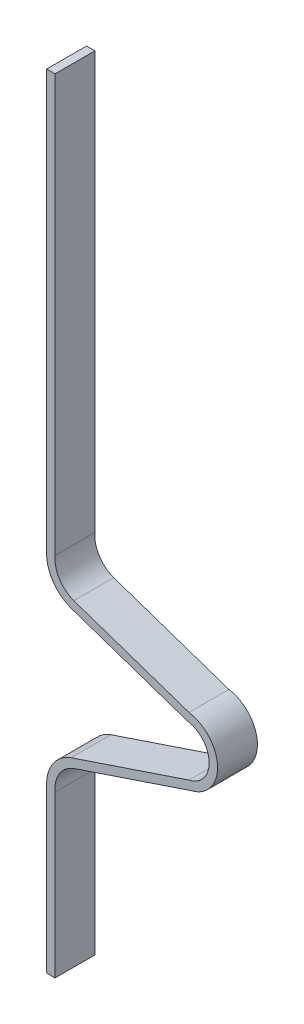
ISO-10303-21;
HEADER;
FILE_DESCRIPTION(('STEP AP214'),'2;1');
FILE_NAME('part.step','',(''),(''),'','','');
FILE_SCHEMA(('AUTOMOTIVE_DESIGN { 1 0 10303 214 1 1 1 1 }'));
ENDSEC;
DATA;
#1=APPLICATION_CONTEXT('core data for automotive mechanical design processes');
#2=APPLICATION_PROTOCOL_DEFINITION('international standard','automotive_design',2000,#1);
#3=PRODUCT_CONTEXT('',#1,'mechanical');
#4=PRODUCT('Part','Part','',(#3));
#5=PRODUCT_RELATED_PRODUCT_CATEGORY('part','',(#4));
#6=PRODUCT_DEFINITION_FORMATION('','',#4);
#7=PRODUCT_DEFINITION_CONTEXT('part definition',#1,'design');
#8=PRODUCT_DEFINITION('design','',#6,#7);
#9=PRODUCT_DEFINITION_SHAPE('','',#8);
#10=(LENGTH_UNIT() NAMED_UNIT(*) SI_UNIT(.MILLI.,.METRE.));
#11=(NAMED_UNIT(*) PLANE_ANGLE_UNIT() SI_UNIT($,.RADIAN.));
#12=(NAMED_UNIT(*) SI_UNIT($,.STERADIAN.) SOLID_ANGLE_UNIT());
#13=UNCERTAINTY_MEASURE_WITH_UNIT(LENGTH_MEASURE(1.E-05),#10,'distance_accuracy_value','');
#14=(GEOMETRIC_REPRESENTATION_CONTEXT(3) GLOBAL_UNCERTAINTY_ASSIGNED_CONTEXT((#13)) GLOBAL_UNIT_ASSIGNED_CONTEXT((#10,
#11,#12)) REPRESENTATION_CONTEXT('',''));
#15=CARTESIAN_POINT('',(0.,0.,0.));
#16=DIRECTION('',(0.,0.,1.));
#17=DIRECTION('',(1.,0.,0.));
#18=AXIS2_PLACEMENT_3D('',#15,#16,#17);
#19=CARTESIAN_POINT('',(7.50002729636842,136.890987131087,-6.2));
#20=DIRECTION('',(0.,0.,1.));
#21=DIRECTION('',(1.,0.,0.));
#22=AXIS2_PLACEMENT_3D('',#19,#20,#21);
#23=CYLINDRICAL_SURFACE('',#22,5.80000000000005);
#24=CARTESIAN_POINT('',(7.50002729636842,136.890987131087,0.));
#25=DIRECTION('',(0.,0.,-1.));
#26=DIRECTION('',(-1.,0.,0.));
#27=AXIS2_PLACEMENT_3D('',#24,#25,#26);
#28=CIRCLE('',#27,5.80000000000005);
#29=CARTESIAN_POINT('',(5.50463373490959,131.445034089158,0.));
#30=VERTEX_POINT('',#29);
#31=CARTESIAN_POINT('',(1.71947576625623,137.365564846238,0.));
#32=VERTEX_POINT('',#31);
#33=EDGE_CURVE('E183',#30,#32,#28,.T.);
#34=ORIENTED_EDGE('',*,*,#33,.T.);
#35=DIRECTION('',(0.,0.,1.));
#36=VECTOR('',#35,1.);
#37=CARTESIAN_POINT('',(1.71947576625623,137.365564846238,-6.2));
#38=LINE('',#37,#36);
#39=CARTESIAN_POINT('',(1.71947576625623,137.365564846238,-6.2));
#40=VERTEX_POINT('',#39);
#41=EDGE_CURVE('E39',#40,#32,#38,.T.);
#42=ORIENTED_EDGE('',*,*,#41,.F.);
#43=CARTESIAN_POINT('',(7.50002729636842,136.890987131087,-6.2));
#44=DIRECTION('',(0.,0.,-1.));
#45=DIRECTION('',(-1.,0.,0.));
#46=AXIS2_PLACEMENT_3D('',#43,#44,#45);
#47=CIRCLE('',#46,5.80000000000005);
#48=CARTESIAN_POINT('',(5.50463373490959,131.445034089158,-6.2));
#49=VERTEX_POINT('',#48);
#50=EDGE_CURVE('E221',#49,#40,#47,.T.);
#51=ORIENTED_EDGE('',*,*,#50,.F.);
#52=DIRECTION('',(0.,0.,1.));
#53=VECTOR('',#52,1.);
#54=CARTESIAN_POINT('',(5.50463373490959,131.445034089158,-6.2));
#55=LINE('',#54,#53);
#56=EDGE_CURVE('E182',#49,#30,#55,.T.);
#57=ORIENTED_EDGE('',*,*,#56,.T.);
#58=EDGE_LOOP('',(#34,#42,#51,#57));
#59=FACE_BOUND('',#58,.T.);
#60=ADVANCED_FACE('F32',(#59),#23,.T.);
#61=CARTESIAN_POINT('',(1.71947576625623,137.365564846238,-6.2));
#62=DIRECTION('',(1.,0.,0.));
#63=DIRECTION('',(0.,1.,0.));
#64=AXIS2_PLACEMENT_3D('',#61,#62,#63);
#65=PLANE('',#64);
#66=DIRECTION('',(0.,1.,0.));
#67=VECTOR('',#66,1.);
#68=CARTESIAN_POINT('',(1.71947576625623,137.365564846238,0.));
#69=LINE('',#68,#67);
#70=CARTESIAN_POINT('',(1.71947576625623,202.142033293371,0.));
#71=VERTEX_POINT('',#70);
#72=EDGE_CURVE('E186',#32,#71,#69,.T.);
#73=ORIENTED_EDGE('',*,*,#72,.T.);
#74=DIRECTION('',(0.,0.,-1.));
#75=VECTOR('',#74,1.);
#76=CARTESIAN_POINT('',(1.71947576625623,202.142033293371,-6.2));
#77=LINE('',#76,#75);
#78=CARTESIAN_POINT('',(1.71947576625623,202.142033293371,-6.2));
#79=VERTEX_POINT('',#78);
#80=EDGE_CURVE('E54',#71,#79,#77,.T.);
#81=ORIENTED_EDGE('',*,*,#80,.T.);
#82=DIRECTION('',(0.,1.,0.));
#83=VECTOR('',#82,1.);
#84=CARTESIAN_POINT('',(1.71947576625623,137.365564846238,-6.2));
#85=LINE('',#84,#83);
#86=EDGE_CURVE('E248',#40,#79,#85,.T.);
#87=ORIENTED_EDGE('',*,*,#86,.F.);
#88=ORIENTED_EDGE('',*,*,#41,.T.);
#89=EDGE_LOOP('',(#73,#81,#87,#88));
#90=FACE_BOUND('',#89,.T.);
#91=ADVANCED_FACE('F246',(#90),#65,.F.);
#92=CARTESIAN_POINT('',(3.01947576625623,137.308908159523,-6.2));
#93=DIRECTION('',(1.,0.,0.));
#94=DIRECTION('',(0.,1.,0.));
#95=AXIS2_PLACEMENT_3D('',#92,#93,#94);
#96=PLANE('',#95);
#97=DIRECTION('',(0.,0.,-1.));
#98=VECTOR('',#97,1.);
#99=CARTESIAN_POINT('',(3.01947576625058,202.142033293371,-6.2));
#100=LINE('',#99,#98);
#101=CARTESIAN_POINT('',(3.01947576625058,202.142033293371,0.));
#102=VERTEX_POINT('',#101);
#103=CARTESIAN_POINT('',(3.01947576625058,202.142033293371,-6.2));
#104=VERTEX_POINT('',#103);
#105=EDGE_CURVE('E277',#102,#104,#100,.T.);
#106=ORIENTED_EDGE('',*,*,#105,.F.);
#107=DIRECTION('',(0.,1.,0.));
#108=VECTOR('',#107,1.);
#109=CARTESIAN_POINT('',(3.01947576625623,137.308908159523,0.));
#110=LINE('',#109,#108);
#111=CARTESIAN_POINT('',(3.01947576625623,137.308908159523,0.));
#112=VERTEX_POINT('',#111);
#113=EDGE_CURVE('E189',#112,#102,#110,.T.);
#114=ORIENTED_EDGE('',*,*,#113,.F.);
#115=DIRECTION('',(0.,0.,1.));
#116=VECTOR('',#115,1.);
#117=CARTESIAN_POINT('',(3.01947576625623,137.308908159523,-6.2));
#118=LINE('',#117,#116);
#119=CARTESIAN_POINT('',(3.01947576625623,137.308908159523,-6.2));
#120=VERTEX_POINT('',#119);
#121=EDGE_CURVE('E242',#120,#112,#118,.T.);
#122=ORIENTED_EDGE('',*,*,#121,.F.);
#123=DIRECTION('',(0.,1.,0.));
#124=VECTOR('',#123,1.);
#125=CARTESIAN_POINT('',(3.01947576625623,137.308908159523,-6.2));
#126=LINE('',#125,#124);
#127=EDGE_CURVE('E287',#120,#104,#126,.T.);
#128=ORIENTED_EDGE('',*,*,#127,.T.);
#129=EDGE_LOOP('',(#106,#114,#122,#128));
#130=FACE_BOUND('',#129,.T.);
#131=ADVANCED_FACE('F323',(#130),#96,.T.);
#132=CARTESIAN_POINT('',(7.50002729636842,136.890987131087,-6.2));
#133=DIRECTION('',(0.,0.,1.));
#134=DIRECTION('',(1.,0.,0.));
#135=AXIS2_PLACEMENT_3D('',#132,#133,#134);
#136=CYLINDRICAL_SURFACE('',#135,4.50000000000005);
#137=CARTESIAN_POINT('',(7.50002729636842,136.890987131087,0.));
#138=DIRECTION('',(0.,0.,-1.));
#139=DIRECTION('',(-1.,0.,0.));
#140=AXIS2_PLACEMENT_3D('',#137,#138,#139);
#141=CIRCLE('',#140,4.50000000000005);
#142=CARTESIAN_POINT('',(5.93858449700011,132.670572887876,0.));
#143=VERTEX_POINT('',#142);
#144=EDGE_CURVE('E192',#143,#112,#141,.T.);
#145=ORIENTED_EDGE('',*,*,#144,.F.);
#146=DIRECTION('',(0.,0.,1.));
#147=VECTOR('',#146,1.);
#148=CARTESIAN_POINT('',(5.93858449700011,132.670572887876,-6.2));
#149=LINE('',#148,#147);
#150=CARTESIAN_POINT('',(5.93858449700011,132.670572887876,-6.2));
#151=VERTEX_POINT('',#150);
#152=EDGE_CURVE('E240',#151,#143,#149,.T.);
#153=ORIENTED_EDGE('',*,*,#152,.F.);
#154=CARTESIAN_POINT('',(7.50002729636842,136.890987131087,-6.2));
#155=DIRECTION('',(0.,0.,-1.));
#156=DIRECTION('',(-1.,0.,0.));
#157=AXIS2_PLACEMENT_3D('',#154,#155,#156);
#158=CIRCLE('',#157,4.50000000000005);
#159=EDGE_CURVE('E290',#151,#120,#158,.T.);
#160=ORIENTED_EDGE('',*,*,#159,.T.);
#161=ORIENTED_EDGE('',*,*,#121,.T.);
#162=EDGE_LOOP('',(#145,#153,#160,#161));
#163=FACE_BOUND('',#162,.T.);
#164=ADVANCED_FACE('F327',(#163),#136,.F.);
#165=CARTESIAN_POINT('',(5.9385844970001,132.670572887876,-6.2));
#166=DIRECTION('',(-0.322097234531556,-0.946706592090244,0.));
#167=DIRECTION('',(0.946706592090244,-0.322097234531556,0.));
#168=AXIS2_PLACEMENT_3D('',#165,#166,#167);
#169=PLANE('',#168);
#170=DIRECTION('',(0.946706592090244,-0.322097234531556,0.));
#171=VECTOR('',#170,1.);
#172=CARTESIAN_POINT('',(5.9385844970001,132.670572887876,0.));
#173=LINE('',#172,#171);
#174=CARTESIAN_POINT('',(23.8530536017611,126.575547243231,0.));
#175=VERTEX_POINT('',#174);
#176=EDGE_CURVE('E195',#143,#175,#173,.T.);
#177=ORIENTED_EDGE('',*,*,#176,.T.);
#178=DIRECTION('',(0.,0.,1.));
#179=VECTOR('',#178,1.);
#180=CARTESIAN_POINT('',(23.8530536017611,126.575547243231,-6.2));
#181=LINE('',#180,#179);
#182=CARTESIAN_POINT('',(23.8530536017611,126.575547243231,-6.2));
#183=VERTEX_POINT('',#182);
#184=EDGE_CURVE('E238',#183,#175,#181,.T.);
#185=ORIENTED_EDGE('',*,*,#184,.F.);
#186=DIRECTION('',(0.946706592090244,-0.322097234531556,0.));
#187=VECTOR('',#186,1.);
#188=CARTESIAN_POINT('',(5.9385844970001,132.670572887876,-6.2));
#189=LINE('',#188,#187);
#190=EDGE_CURVE('E293',#151,#183,#189,.T.);
#191=ORIENTED_EDGE('',*,*,#190,.F.);
#192=ORIENTED_EDGE('',*,*,#152,.T.);
#193=EDGE_LOOP('',(#177,#185,#191,#192));
#194=FACE_BOUND('',#193,.T.);
#195=ADVANCED_FACE('F333',(#194),#169,.F.);
#196=CARTESIAN_POINT('',(23.0000272963693,121.361325624567,-6.2));
#197=DIRECTION('',(0.,0.,1.));
#198=DIRECTION('',(1.,0.,0.));
#199=AXIS2_PLACEMENT_3D('',#196,#197,#198);
#200=CYLINDRICAL_SURFACE('',#199,5.28353678573665);
#201=CARTESIAN_POINT('',(23.0000272963693,121.361325624567,0.));
#202=DIRECTION('',(0.,0.,1.));
#203=DIRECTION('',(1.,0.,0.));
#204=AXIS2_PLACEMENT_3D('',#201,#202,#203);
#205=CIRCLE('',#204,5.28353678573665);
#206=CARTESIAN_POINT('',(24.1981690487475,116.215432377769,0.));
#207=VERTEX_POINT('',#206);
#208=EDGE_CURVE('E198',#207,#175,#205,.T.);
#209=ORIENTED_EDGE('',*,*,#208,.F.);
#210=DIRECTION('',(0.,0.,1.));
#211=VECTOR('',#210,1.);
#212=CARTESIAN_POINT('',(24.1981690487475,116.215432377769,-6.2));
#213=LINE('',#212,#211);
#214=CARTESIAN_POINT('',(24.1981690487475,116.215432377769,-6.2));
#215=VERTEX_POINT('',#214);
#216=EDGE_CURVE('E236',#215,#207,#213,.T.);
#217=ORIENTED_EDGE('',*,*,#216,.F.);
#218=CARTESIAN_POINT('',(23.0000272963693,121.361325624567,-6.2));
#219=DIRECTION('',(0.,0.,1.));
#220=DIRECTION('',(1.,0.,0.));
#221=AXIS2_PLACEMENT_3D('',#218,#219,#220);
#222=CIRCLE('',#221,5.28353678573665);
#223=EDGE_CURVE('E295',#215,#183,#222,.T.);
#224=ORIENTED_EDGE('',*,*,#223,.T.);
#225=ORIENTED_EDGE('',*,*,#184,.T.);
#226=EDGE_LOOP('',(#209,#217,#224,#225));
#227=FACE_BOUND('',#226,.T.);
#228=ADVANCED_FACE('F307',(#227),#200,.T.);
#229=CARTESIAN_POINT('',(5.93769252692713,110.081409755031,-6.2));
#230=DIRECTION('',(0.318432016999955,-0.947945700211431,0.));
#231=DIRECTION('',(0.947945700211431,0.318432016999955,0.));
#232=AXIS2_PLACEMENT_3D('',#229,#230,#231);
#233=PLANE('',#232);
#234=DIRECTION('',(0.947945700211431,0.318432016999955,0.));
#235=VECTOR('',#234,1.);
#236=CARTESIAN_POINT('',(5.93769252692713,110.081409755031,0.));
#237=LINE('',#236,#235);
#238=CARTESIAN_POINT('',(5.93769252692713,110.081409755031,0.));
#239=VERTEX_POINT('',#238);
#240=EDGE_CURVE('E201',#239,#207,#237,.T.);
#241=ORIENTED_EDGE('',*,*,#240,.F.);
#242=DIRECTION('',(0.,0.,1.));
#243=VECTOR('',#242,1.);
#244=CARTESIAN_POINT('',(5.93769252692713,110.081409755031,-6.2));
#245=LINE('',#244,#243);
#246=CARTESIAN_POINT('',(5.93769252692713,110.081409755031,-6.2));
#247=VERTEX_POINT('',#246);
#248=EDGE_CURVE('E234',#247,#239,#245,.T.);
#249=ORIENTED_EDGE('',*,*,#248,.F.);
#250=DIRECTION('',(0.947945700211431,0.318432016999955,0.));
#251=VECTOR('',#250,1.);
#252=CARTESIAN_POINT('',(5.93769252692713,110.081409755031,-6.2));
#253=LINE('',#252,#251);
#254=EDGE_CURVE('E169',#247,#215,#253,.T.);
#255=ORIENTED_EDGE('',*,*,#254,.T.);
#256=ORIENTED_EDGE('',*,*,#216,.T.);
#257=EDGE_LOOP('',(#241,#249,#255,#256));
#258=FACE_BOUND('',#257,.T.);
#259=ADVANCED_FACE('F300',(#258),#233,.T.);
#260=CARTESIAN_POINT('',(7.50002729636842,105.861325624567,-6.2));
#261=DIRECTION('',(0.,0.,1.));
#262=DIRECTION('',(1.,0.,0.));
#263=AXIS2_PLACEMENT_3D('',#260,#261,#262);
#264=CYLINDRICAL_SURFACE('',#263,4.49999999999999);
#265=CARTESIAN_POINT('',(7.50002729636842,105.861325624567,0.));
#266=DIRECTION('',(0.,0.,1.));
#267=DIRECTION('',(1.,0.,0.));
#268=AXIS2_PLACEMENT_3D('',#265,#266,#267);
#269=CIRCLE('',#268,4.49999999999999);
#270=CARTESIAN_POINT('',(3.01947576625624,105.443404596131,0.));
#271=VERTEX_POINT('',#270);
#272=EDGE_CURVE('E204',#239,#271,#269,.T.);
#273=ORIENTED_EDGE('',*,*,#272,.T.);
#274=DIRECTION('',(0.,0.,1.));
#275=VECTOR('',#274,1.);
#276=CARTESIAN_POINT('',(3.01947576625624,105.443404596131,-6.2));
#277=LINE('',#276,#275);
#278=CARTESIAN_POINT('',(3.01947576625624,105.443404596131,-6.2));
#279=VERTEX_POINT('',#278);
#280=EDGE_CURVE('E232',#279,#271,#277,.T.);
#281=ORIENTED_EDGE('',*,*,#280,.F.);
#282=CARTESIAN_POINT('',(7.50002729636842,105.861325624567,-6.2));
#283=DIRECTION('',(0.,0.,1.));
#284=DIRECTION('',(1.,0.,0.));
#285=AXIS2_PLACEMENT_3D('',#282,#283,#284);
#286=CIRCLE('',#285,4.49999999999999);
#287=EDGE_CURVE('E163',#247,#279,#286,.T.);
#288=ORIENTED_EDGE('',*,*,#287,.F.);
#289=ORIENTED_EDGE('',*,*,#248,.T.);
#290=EDGE_LOOP('',(#273,#281,#288,#289));
#291=FACE_BOUND('',#290,.T.);
#292=ADVANCED_FACE('F310',(#291),#264,.F.);
#293=CARTESIAN_POINT('',(3.01947576625623,105.443404596131,-6.2));
#294=DIRECTION('',(-1.,0.,0.));
#295=DIRECTION('',(0.,-1.,0.));
#296=AXIS2_PLACEMENT_3D('',#293,#294,#295);
#297=PLANE('',#296);
#298=DIRECTION('',(0.,-1.,0.));
#299=VECTOR('',#298,1.);
#300=CARTESIAN_POINT('',(3.01947576625623,105.443404596131,0.));
#301=LINE('',#300,#299);
#302=CARTESIAN_POINT('',(3.01947576625623,80.4063512397133,0.));
#303=VERTEX_POINT('',#302);
#304=EDGE_CURVE('E158',#271,#303,#301,.T.);
#305=ORIENTED_EDGE('',*,*,#304,.T.);
#306=DIRECTION('',(0.,0.,1.));
#307=VECTOR('',#306,1.);
#308=CARTESIAN_POINT('',(3.01947576625848,80.4063512397133,-6.2));
#309=LINE('',#308,#307);
#310=CARTESIAN_POINT('',(3.01947576625848,80.4063512397133,-6.2));
#311=VERTEX_POINT('',#310);
#312=EDGE_CURVE('E46',#311,#303,#309,.T.);
#313=ORIENTED_EDGE('',*,*,#312,.F.);
#314=DIRECTION('',(0.,-1.,0.));
#315=VECTOR('',#314,1.);
#316=CARTESIAN_POINT('',(3.01947576625623,105.443404596131,-6.2));
#317=LINE('',#316,#315);
#318=EDGE_CURVE('E156',#279,#311,#317,.T.);
#319=ORIENTED_EDGE('',*,*,#318,.F.);
#320=ORIENTED_EDGE('',*,*,#280,.T.);
#321=EDGE_LOOP('',(#305,#313,#319,#320));
#322=FACE_BOUND('',#321,.T.);
#323=ADVANCED_FACE('F154',(#322),#297,.F.);
#324=CARTESIAN_POINT('',(1.71947576625623,105.386747909417,-6.2));
#325=DIRECTION('',(-1.,0.,0.));
#326=DIRECTION('',(0.,-1.,0.));
#327=AXIS2_PLACEMENT_3D('',#324,#325,#326);
#328=PLANE('',#327);
#329=DIRECTION('',(0.,0.,-1.));
#330=VECTOR('',#329,1.);
#331=CARTESIAN_POINT('',(1.71947576625623,80.4063512397133,-6.2));
#332=LINE('',#331,#330);
#333=CARTESIAN_POINT('',(1.71947576625623,80.4063512397133,0.));
#334=VERTEX_POINT('',#333);
#335=CARTESIAN_POINT('',(1.71947576625623,80.4063512397133,-6.2));
#336=VERTEX_POINT('',#335);
#337=EDGE_CURVE('E144',#334,#336,#332,.T.);
#338=ORIENTED_EDGE('',*,*,#337,.F.);
#339=DIRECTION('',(0.,-1.,0.));
#340=VECTOR('',#339,1.);
#341=CARTESIAN_POINT('',(1.71947576625623,105.386747909417,0.));
#342=LINE('',#341,#340);
#343=CARTESIAN_POINT('',(1.71947576625623,105.386747909417,0.));
#344=VERTEX_POINT('',#343);
#345=EDGE_CURVE('E207',#344,#334,#342,.T.);
#346=ORIENTED_EDGE('',*,*,#345,.F.);
#347=DIRECTION('',(0.,0.,1.));
#348=VECTOR('',#347,1.);
#349=CARTESIAN_POINT('',(1.71947576625623,105.386747909417,-6.2));
#350=LINE('',#349,#348);
#351=CARTESIAN_POINT('',(1.71947576625623,105.386747909417,-6.2));
#352=VERTEX_POINT('',#351);
#353=EDGE_CURVE('E230',#352,#344,#350,.T.);
#354=ORIENTED_EDGE('',*,*,#353,.F.);
#355=DIRECTION('',(0.,-1.,0.));
#356=VECTOR('',#355,1.);
#357=CARTESIAN_POINT('',(1.71947576625623,105.386747909417,-6.2));
#358=LINE('',#357,#356);
#359=EDGE_CURVE('E165',#352,#336,#358,.T.);
#360=ORIENTED_EDGE('',*,*,#359,.T.);
#361=EDGE_LOOP('',(#338,#346,#354,#360));
#362=FACE_BOUND('',#361,.T.);
#363=ADVANCED_FACE('F274',(#362),#328,.T.);
#364=CARTESIAN_POINT('',(7.50002729636842,105.861325624567,-6.2));
#365=DIRECTION('',(0.,0.,1.));
#366=DIRECTION('',(1.,0.,0.));
#367=AXIS2_PLACEMENT_3D('',#364,#365,#366);
#368=CYLINDRICAL_SURFACE('',#367,5.8);
#369=CARTESIAN_POINT('',(7.50002729636842,105.861325624567,0.));
#370=DIRECTION('',(0.,0.,1.));
#371=DIRECTION('',(1.,0.,0.));
#372=AXIS2_PLACEMENT_3D('',#369,#370,#371);
#373=CIRCLE('',#372,5.8);
#374=CARTESIAN_POINT('',(5.50613135155277,111.307827158694,0.));
#375=VERTEX_POINT('',#374);
#376=EDGE_CURVE('E210',#375,#344,#373,.T.);
#377=ORIENTED_EDGE('',*,*,#376,.F.);
#378=DIRECTION('',(0.,0.,1.));
#379=VECTOR('',#378,1.);
#380=CARTESIAN_POINT('',(5.50613135155277,111.307827158694,-6.2));
#381=LINE('',#380,#379);
#382=CARTESIAN_POINT('',(5.50613135155277,111.307827158694,-6.2));
#383=VERTEX_POINT('',#382);
#384=EDGE_CURVE('E228',#383,#375,#381,.T.);
#385=ORIENTED_EDGE('',*,*,#384,.F.);
#386=CARTESIAN_POINT('',(7.50002729636842,105.861325624567,-6.2));
#387=DIRECTION('',(0.,0.,1.));
#388=DIRECTION('',(1.,0.,0.));
#389=AXIS2_PLACEMENT_3D('',#386,#387,#388);
#390=CIRCLE('',#389,5.8);
#391=EDGE_CURVE('E167',#383,#352,#390,.T.);
#392=ORIENTED_EDGE('',*,*,#391,.T.);
#393=ORIENTED_EDGE('',*,*,#353,.T.);
#394=EDGE_LOOP('',(#377,#385,#392,#393));
#395=FACE_BOUND('',#394,.T.);
#396=ADVANCED_FACE('F269',(#395),#368,.T.);
#397=CARTESIAN_POINT('',(5.50613135155277,111.307827158694,-6.2));
#398=DIRECTION('',(0.318432016999952,-0.947945700211432,0.));
#399=DIRECTION('',(0.947945700211432,0.318432016999952,0.));
#400=AXIS2_PLACEMENT_3D('',#397,#398,#399);
#401=PLANE('',#400);
#402=DIRECTION('',(0.947945700211432,0.318432016999952,0.));
#403=VECTOR('',#402,1.);
#404=CARTESIAN_POINT('',(5.50613135155277,111.307827158694,0.));
#405=LINE('',#404,#403);
#406=CARTESIAN_POINT('',(23.8471362015121,117.468900695792,0.));
#407=VERTEX_POINT('',#406);
#408=EDGE_CURVE('E213',#375,#407,#405,.T.);
#409=ORIENTED_EDGE('',*,*,#408,.T.);
#410=DIRECTION('',(0.,0.,1.));
#411=VECTOR('',#410,1.);
#412=CARTESIAN_POINT('',(23.8471362015121,117.468900695792,-6.2));
#413=LINE('',#412,#411);
#414=CARTESIAN_POINT('',(23.8471362015121,117.468900695792,-6.2));
#415=VERTEX_POINT('',#414);
#416=EDGE_CURVE('E225',#415,#407,#413,.T.);
#417=ORIENTED_EDGE('',*,*,#416,.F.);
#418=DIRECTION('',(0.947945700211432,0.318432016999952,0.));
#419=VECTOR('',#418,1.);
#420=CARTESIAN_POINT('',(5.50613135155277,111.307827158694,-6.2));
#421=LINE('',#420,#419);
#422=EDGE_CURVE('E175',#383,#415,#421,.T.);
#423=ORIENTED_EDGE('',*,*,#422,.F.);
#424=ORIENTED_EDGE('',*,*,#384,.T.);
#425=EDGE_LOOP('',(#409,#417,#423,#424));
#426=FACE_BOUND('',#425,.T.);
#427=ADVANCED_FACE('F361',(#426),#401,.F.);
#428=CARTESIAN_POINT('',(23.0000272963693,121.361325624567,-6.2));
#429=DIRECTION('',(0.,0.,1.));
#430=DIRECTION('',(1.,0.,0.));
#431=AXIS2_PLACEMENT_3D('',#428,#429,#430);
#432=CYLINDRICAL_SURFACE('',#431,3.98353678573665);
#433=CARTESIAN_POINT('',(23.0000272963693,121.361325624567,0.));
#434=DIRECTION('',(0.,0.,1.));
#435=DIRECTION('',(1.,0.,0.));
#436=AXIS2_PLACEMENT_3D('',#433,#434,#435);
#437=CIRCLE('',#436,3.98353678573665);
#438=CARTESIAN_POINT('',(23.5438434058974,125.307568060395,0.));
#439=VERTEX_POINT('',#438);
#440=EDGE_CURVE('E215',#407,#439,#437,.T.);
#441=ORIENTED_EDGE('',*,*,#440,.T.);
#442=DIRECTION('',(0.,0.,1.));
#443=VECTOR('',#442,1.);
#444=CARTESIAN_POINT('',(23.5438434058974,125.307568060395,-6.2));
#445=LINE('',#444,#443);
#446=CARTESIAN_POINT('',(23.5438434058974,125.307568060395,-6.2));
#447=VERTEX_POINT('',#446);
#448=EDGE_CURVE('E223',#447,#439,#445,.T.);
#449=ORIENTED_EDGE('',*,*,#448,.F.);
#450=CARTESIAN_POINT('',(23.0000272963693,121.361325624567,-6.2));
#451=DIRECTION('',(0.,0.,1.));
#452=DIRECTION('',(1.,0.,0.));
#453=AXIS2_PLACEMENT_3D('',#450,#451,#452);
#454=CIRCLE('',#453,3.98353678573665);
#455=EDGE_CURVE('E177',#415,#447,#454,.T.);
#456=ORIENTED_EDGE('',*,*,#455,.F.);
#457=ORIENTED_EDGE('',*,*,#416,.T.);
#458=EDGE_LOOP('',(#441,#449,#456,#457));
#459=FACE_BOUND('',#458,.T.);
#460=ADVANCED_FACE('F263',(#459),#432,.F.);
#461=CARTESIAN_POINT('',(5.50463373490959,131.445034089158,-6.2));
#462=DIRECTION('',(-0.322097234531554,-0.946706592090245,0.));
#463=DIRECTION('',(0.946706592090245,-0.322097234531554,0.));
#464=AXIS2_PLACEMENT_3D('',#461,#462,#463);
#465=PLANE('',#464);
#466=DIRECTION('',(0.946706592090245,-0.322097234531554,0.));
#467=VECTOR('',#466,1.);
#468=CARTESIAN_POINT('',(5.50463373490959,131.445034089158,0.));
#469=LINE('',#468,#467);
#470=EDGE_CURVE('E218',#30,#439,#469,.T.);
#471=ORIENTED_EDGE('',*,*,#470,.F.);
#472=ORIENTED_EDGE('',*,*,#56,.F.);
#473=DIRECTION('',(0.946706592090245,-0.322097234531554,0.));
#474=VECTOR('',#473,1.);
#475=CARTESIAN_POINT('',(5.50463373490959,131.445034089158,-6.2));
#476=LINE('',#475,#474);
#477=EDGE_CURVE('E179',#49,#447,#476,.T.);
#478=ORIENTED_EDGE('',*,*,#477,.T.);
#479=ORIENTED_EDGE('',*,*,#448,.T.);
#480=EDGE_LOOP('',(#471,#472,#478,#479));
#481=FACE_BOUND('',#480,.T.);
#482=ADVANCED_FACE('F258',(#481),#465,.T.);
#483=CARTESIAN_POINT('',(7.50002729636842,136.890987131087,-6.2));
#484=DIRECTION('',(0.,0.,-1.));
#485=DIRECTION('',(-1.,0.,0.));
#486=AXIS2_PLACEMENT_3D('',#483,#484,#485);
#487=PLANE('',#486);
#488=DIRECTION('',(1.,0.,0.));
#489=VECTOR('',#488,1.);
#490=CARTESIAN_POINT('',(-6.98052423374152,80.4063512397136,-6.2));
#491=LINE('',#490,#489);
#492=EDGE_CURVE('E141',#336,#311,#491,.T.);
#493=ORIENTED_EDGE('',*,*,#492,.F.);
#494=ORIENTED_EDGE('',*,*,#359,.F.);
#495=ORIENTED_EDGE('',*,*,#391,.F.);
#496=ORIENTED_EDGE('',*,*,#422,.T.);
#497=ORIENTED_EDGE('',*,*,#455,.T.);
#498=ORIENTED_EDGE('',*,*,#477,.F.);
#499=ORIENTED_EDGE('',*,*,#50,.T.);
#500=ORIENTED_EDGE('',*,*,#86,.T.);
#501=DIRECTION('',(1.,0.,0.));
#502=VECTOR('',#501,1.);
#503=CARTESIAN_POINT('',(-6.98052423374942,202.142033293371,-6.2));
#504=LINE('',#503,#502);
#505=EDGE_CURVE('E281',#79,#104,#504,.T.);
#506=ORIENTED_EDGE('',*,*,#505,.T.);
#507=ORIENTED_EDGE('',*,*,#127,.F.);
#508=ORIENTED_EDGE('',*,*,#159,.F.);
#509=ORIENTED_EDGE('',*,*,#190,.T.);
#510=ORIENTED_EDGE('',*,*,#223,.F.);
#511=ORIENTED_EDGE('',*,*,#254,.F.);
#512=ORIENTED_EDGE('',*,*,#287,.T.);
#513=ORIENTED_EDGE('',*,*,#318,.T.);
#514=EDGE_LOOP('',(#493,#494,#495,#496,#497,#498,#499,#500,#506,#507,#508,#509,#510,#511,#512,#513));
#515=FACE_BOUND('',#514,.T.);
#516=ADVANCED_FACE('F160',(#515),#487,.T.);
#517=CARTESIAN_POINT('',(7.50002729636842,136.890987131087,0.));
#518=DIRECTION('',(0.,0.,-1.));
#519=DIRECTION('',(-1.,0.,0.));
#520=AXIS2_PLACEMENT_3D('',#517,#518,#519);
#521=PLANE('',#520);
#522=ORIENTED_EDGE('',*,*,#345,.T.);
#523=DIRECTION('',(1.,0.,0.));
#524=VECTOR('',#523,1.);
#525=CARTESIAN_POINT('',(-6.98052423374152,80.4063512397136,0.));
#526=LINE('',#525,#524);
#527=EDGE_CURVE('E149',#334,#303,#526,.T.);
#528=ORIENTED_EDGE('',*,*,#527,.T.);
#529=ORIENTED_EDGE('',*,*,#304,.F.);
#530=ORIENTED_EDGE('',*,*,#272,.F.);
#531=ORIENTED_EDGE('',*,*,#240,.T.);
#532=ORIENTED_EDGE('',*,*,#208,.T.);
#533=ORIENTED_EDGE('',*,*,#176,.F.);
#534=ORIENTED_EDGE('',*,*,#144,.T.);
#535=ORIENTED_EDGE('',*,*,#113,.T.);
#536=DIRECTION('',(-1.,0.,0.));
#537=VECTOR('',#536,1.);
#538=CARTESIAN_POINT('',(7.5000272963666,202.142033293371,0.));
#539=LINE('',#538,#537);
#540=EDGE_CURVE('E11',#102,#71,#539,.T.);
#541=ORIENTED_EDGE('',*,*,#540,.T.);
#542=ORIENTED_EDGE('',*,*,#72,.F.);
#543=ORIENTED_EDGE('',*,*,#33,.F.);
#544=ORIENTED_EDGE('',*,*,#470,.T.);
#545=ORIENTED_EDGE('',*,*,#440,.F.);
#546=ORIENTED_EDGE('',*,*,#408,.F.);
#547=ORIENTED_EDGE('',*,*,#376,.T.);
#548=EDGE_LOOP('',(#522,#528,#529,#530,#531,#532,#533,#534,#535,#541,#542,#543,#544,#545,#546,#547));
#549=FACE_BOUND('',#548,.T.);
#550=ADVANCED_FACE('F255',(#549),#521,.F.);
#551=CARTESIAN_POINT('',(-6.98052423374942,202.142033293371,-6.2));
#552=DIRECTION('',(0.,-1.,0.));
#553=DIRECTION('',(1.,0.,0.));
#554=AXIS2_PLACEMENT_3D('',#551,#552,#553);
#555=PLANE('',#554);
#556=ORIENTED_EDGE('',*,*,#540,.F.);
#557=ORIENTED_EDGE('',*,*,#105,.T.);
#558=ORIENTED_EDGE('',*,*,#505,.F.);
#559=ORIENTED_EDGE('',*,*,#80,.F.);
#560=EDGE_LOOP('',(#556,#557,#558,#559));
#561=FACE_BOUND('',#560,.T.);
#562=ADVANCED_FACE('F406',(#561),#555,.F.);
#563=CARTESIAN_POINT('',(-6.98052423374152,80.4063512397136,-6.2));
#564=DIRECTION('',(0.,1.,0.));
#565=DIRECTION('',(-1.,0.,0.));
#566=AXIS2_PLACEMENT_3D('',#563,#564,#565);
#567=PLANE('',#566);
#568=ORIENTED_EDGE('',*,*,#337,.T.);
#569=ORIENTED_EDGE('',*,*,#492,.T.);
#570=ORIENTED_EDGE('',*,*,#312,.T.);
#571=ORIENTED_EDGE('',*,*,#527,.F.);
#572=EDGE_LOOP('',(#568,#569,#570,#571));
#573=FACE_BOUND('',#572,.T.);
#574=ADVANCED_FACE('F142',(#573),#567,.F.);
#575=CLOSED_SHELL('',(#60,#91,#131,#164,#195,#228,#259,#292,#323,#363,#396,#427,#460,#482,#516,
#550,#562,#574));
#576=MANIFOLD_SOLID_BREP('B2',#575);
#577=ADVANCED_BREP_SHAPE_REPRESENTATION('',(#18,#576),#14);
#578=SHAPE_DEFINITION_REPRESENTATION(#9,#577);
ENDSEC;
END-ISO-10303-21;
